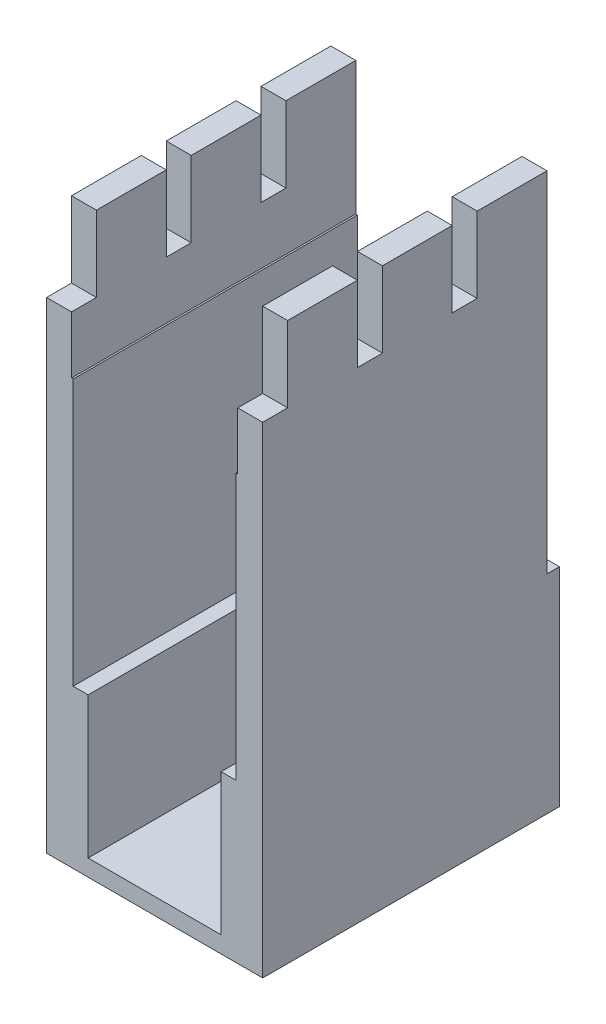
ISO-10303-21;
HEADER;
FILE_DESCRIPTION(('STEP AP214'),'2;1');
FILE_NAME('part.step','',(''),(''),'','','');
FILE_SCHEMA(('AUTOMOTIVE_DESIGN { 1 0 10303 214 1 1 1 1 }'));
ENDSEC;
DATA;
#1=APPLICATION_CONTEXT('core data for automotive mechanical design processes');
#2=APPLICATION_PROTOCOL_DEFINITION('international standard','automotive_design',2000,#1);
#3=PRODUCT_CONTEXT('',#1,'mechanical');
#4=PRODUCT('Part','Part','',(#3));
#5=PRODUCT_RELATED_PRODUCT_CATEGORY('part','',(#4));
#6=PRODUCT_DEFINITION_FORMATION('','',#4);
#7=PRODUCT_DEFINITION_CONTEXT('part definition',#1,'design');
#8=PRODUCT_DEFINITION('design','',#6,#7);
#9=PRODUCT_DEFINITION_SHAPE('','',#8);
#10=(LENGTH_UNIT() NAMED_UNIT(*) SI_UNIT(.MILLI.,.METRE.));
#11=(NAMED_UNIT(*) PLANE_ANGLE_UNIT() SI_UNIT($,.RADIAN.));
#12=(NAMED_UNIT(*) SI_UNIT($,.STERADIAN.) SOLID_ANGLE_UNIT());
#13=UNCERTAINTY_MEASURE_WITH_UNIT(LENGTH_MEASURE(1.E-05),#10,'distance_accuracy_value','');
#14=(GEOMETRIC_REPRESENTATION_CONTEXT(3) GLOBAL_UNCERTAINTY_ASSIGNED_CONTEXT((#13)) GLOBAL_UNIT_ASSIGNED_CONTEXT((#10,
#11,#12)) REPRESENTATION_CONTEXT('',''));
#15=CARTESIAN_POINT('',(0.,0.,0.));
#16=DIRECTION('',(0.,0.,1.));
#17=DIRECTION('',(1.,0.,0.));
#18=AXIS2_PLACEMENT_3D('',#15,#16,#17);
#19=CARTESIAN_POINT('',(0.,0.,0.));
#20=DIRECTION('',(0.,0.,1.));
#21=DIRECTION('',(1.,0.,0.));
#22=AXIS2_PLACEMENT_3D('',#19,#20,#21);
#23=PLANE('',#22);
#24=DIRECTION('',(1.,0.,0.));
#25=VECTOR('',#24,1.);
#26=CARTESIAN_POINT('',(13.,25.,0.));
#27=LINE('',#26,#25);
#28=CARTESIAN_POINT('',(-13.,25.,0.));
#29=VERTEX_POINT('',#28);
#30=CARTESIAN_POINT('',(-9.8,25.,0.));
#31=VERTEX_POINT('',#30);
#32=EDGE_CURVE('E50',#29,#31,#27,.T.);
#33=ORIENTED_EDGE('',*,*,#32,.F.);
#34=DIRECTION('',(0.,-1.,0.));
#35=VECTOR('',#34,1.);
#36=CARTESIAN_POINT('',(-13.,67.,0.));
#37=LINE('',#36,#35);
#38=CARTESIAN_POINT('',(-13.,67.,0.));
#39=VERTEX_POINT('',#38);
#40=EDGE_CURVE('E522',#39,#29,#37,.T.);
#41=ORIENTED_EDGE('',*,*,#40,.F.);
#42=DIRECTION('',(-1.,0.,0.));
#43=VECTOR('',#42,1.);
#44=CARTESIAN_POINT('',(-10.,67.,0.));
#45=LINE('',#44,#43);
#46=CARTESIAN_POINT('',(-10.,67.,0.));
#47=VERTEX_POINT('',#46);
#48=EDGE_CURVE('E518',#47,#39,#45,.T.);
#49=ORIENTED_EDGE('',*,*,#48,.F.);
#50=DIRECTION('',(0.,1.,0.));
#51=VECTOR('',#50,1.);
#52=CARTESIAN_POINT('',(-10.,51.,0.));
#53=LINE('',#52,#51);
#54=CARTESIAN_POINT('',(-10.,51.,0.));
#55=VERTEX_POINT('',#54);
#56=EDGE_CURVE('E573',#55,#47,#53,.T.);
#57=ORIENTED_EDGE('',*,*,#56,.F.);
#58=DIRECTION('',(-1.,0.,0.));
#59=VECTOR('',#58,1.);
#60=CARTESIAN_POINT('',(-9.8,51.,0.));
#61=LINE('',#60,#59);
#62=CARTESIAN_POINT('',(-9.8,51.,0.));
#63=VERTEX_POINT('',#62);
#64=EDGE_CURVE('E569',#63,#55,#61,.T.);
#65=ORIENTED_EDGE('',*,*,#64,.F.);
#66=DIRECTION('',(0.,1.,0.));
#67=VECTOR('',#66,1.);
#68=CARTESIAN_POINT('',(-9.8,51.,0.));
#69=LINE('',#68,#67);
#70=EDGE_CURVE('E564',#31,#63,#69,.T.);
#71=ORIENTED_EDGE('',*,*,#70,.F.);
#72=EDGE_LOOP('',(#33,#41,#49,#57,#65,#71));
#73=FACE_BOUND('',#72,.T.);
#74=ADVANCED_FACE('F39',(#73),#23,.F.);
#75=CARTESIAN_POINT('',(9.8,25.,0.));
#76=VERTEX_POINT('',#75);
#77=CARTESIAN_POINT('',(13.,25.,0.));
#78=VERTEX_POINT('',#77);
#79=EDGE_CURVE('E11',#76,#78,#27,.T.);
#80=ORIENTED_EDGE('',*,*,#79,.F.);
#81=DIRECTION('',(0.,-1.,0.));
#82=VECTOR('',#81,1.);
#83=CARTESIAN_POINT('',(9.8,51.,0.));
#84=LINE('',#83,#82);
#85=CARTESIAN_POINT('',(9.8,51.,0.));
#86=VERTEX_POINT('',#85);
#87=EDGE_CURVE('E541',#86,#76,#84,.T.);
#88=ORIENTED_EDGE('',*,*,#87,.F.);
#89=DIRECTION('',(-1.,0.,0.));
#90=VECTOR('',#89,1.);
#91=CARTESIAN_POINT('',(10.,51.,0.));
#92=LINE('',#91,#90);
#93=CARTESIAN_POINT('',(10.,51.,0.));
#94=VERTEX_POINT('',#93);
#95=EDGE_CURVE('E536',#94,#86,#92,.T.);
#96=ORIENTED_EDGE('',*,*,#95,.F.);
#97=DIRECTION('',(0.,-1.,0.));
#98=VECTOR('',#97,1.);
#99=CARTESIAN_POINT('',(10.,67.,0.));
#100=LINE('',#99,#98);
#101=CARTESIAN_POINT('',(10.,67.,0.));
#102=VERTEX_POINT('',#101);
#103=EDGE_CURVE('E532',#102,#94,#100,.T.);
#104=ORIENTED_EDGE('',*,*,#103,.F.);
#105=DIRECTION('',(-1.,0.,0.));
#106=VECTOR('',#105,1.);
#107=CARTESIAN_POINT('',(13.,67.,0.));
#108=LINE('',#107,#106);
#109=CARTESIAN_POINT('',(13.,67.,0.));
#110=VERTEX_POINT('',#109);
#111=EDGE_CURVE('E528',#110,#102,#108,.T.);
#112=ORIENTED_EDGE('',*,*,#111,.F.);
#113=DIRECTION('',(0.,1.,0.));
#114=VECTOR('',#113,1.);
#115=CARTESIAN_POINT('',(13.,0.,0.));
#116=LINE('',#115,#114);
#117=EDGE_CURVE('E525',#78,#110,#116,.T.);
#118=ORIENTED_EDGE('',*,*,#117,.F.);
#119=EDGE_LOOP('',(#80,#88,#96,#104,#112,#118));
#120=FACE_BOUND('',#119,.T.);
#121=ADVANCED_FACE('F727',(#120),#23,.F.);
#122=CARTESIAN_POINT('',(-10.,67.,54.));
#123=DIRECTION('',(0.,-1.,0.));
#124=DIRECTION('',(0.,0.,-1.));
#125=AXIS2_PLACEMENT_3D('',#122,#123,#124);
#126=PLANE('',#125);
#127=DIRECTION('',(1.,0.,0.));
#128=VECTOR('',#127,1.);
#129=CARTESIAN_POINT('',(-13.,67.,31.2));
#130=LINE('',#129,#128);
#131=CARTESIAN_POINT('',(-13.,67.,31.2));
#132=VERTEX_POINT('',#131);
#133=CARTESIAN_POINT('',(-10.,67.,31.2));
#134=VERTEX_POINT('',#133);
#135=EDGE_CURVE('E356',#132,#134,#130,.T.);
#136=ORIENTED_EDGE('',*,*,#135,.T.);
#137=DIRECTION('',(0.,0.,-1.));
#138=VECTOR('',#137,1.);
#139=CARTESIAN_POINT('',(-10.,67.,54.));
#140=LINE('',#139,#138);
#141=CARTESIAN_POINT('',(-10.,67.,22.8));
#142=VERTEX_POINT('',#141);
#143=EDGE_CURVE('E581',#134,#142,#140,.T.);
#144=ORIENTED_EDGE('',*,*,#143,.T.);
#145=DIRECTION('',(1.,0.,0.));
#146=VECTOR('',#145,1.);
#147=CARTESIAN_POINT('',(-13.,67.,22.8));
#148=LINE('',#147,#146);
#149=CARTESIAN_POINT('',(-13.,67.,22.8));
#150=VERTEX_POINT('',#149);
#151=EDGE_CURVE('E452',#150,#142,#148,.T.);
#152=ORIENTED_EDGE('',*,*,#151,.F.);
#153=DIRECTION('',(0.,0.,-1.));
#154=VECTOR('',#153,1.);
#155=CARTESIAN_POINT('',(-13.,67.,54.));
#156=LINE('',#155,#154);
#157=EDGE_CURVE('E630',#132,#150,#156,.T.);
#158=ORIENTED_EDGE('',*,*,#157,.F.);
#159=EDGE_LOOP('',(#136,#144,#152,#158));
#160=FACE_BOUND('',#159,.T.);
#161=ADVANCED_FACE('F41',(#160),#126,.F.);
#162=DIRECTION('',(1.,0.,0.));
#163=VECTOR('',#162,1.);
#164=CARTESIAN_POINT('',(-13.,67.,8.4));
#165=LINE('',#164,#163);
#166=CARTESIAN_POINT('',(-13.,67.,8.4));
#167=VERTEX_POINT('',#166);
#168=CARTESIAN_POINT('',(-10.,67.,8.4));
#169=VERTEX_POINT('',#168);
#170=EDGE_CURVE('E378',#167,#169,#165,.T.);
#171=ORIENTED_EDGE('',*,*,#170,.T.);
#172=EDGE_CURVE('E577',#169,#47,#140,.T.);
#173=ORIENTED_EDGE('',*,*,#172,.T.);
#174=ORIENTED_EDGE('',*,*,#48,.T.);
#175=EDGE_CURVE('E626',#167,#39,#156,.T.);
#176=ORIENTED_EDGE('',*,*,#175,.F.);
#177=EDGE_LOOP('',(#171,#173,#174,#176));
#178=FACE_BOUND('',#177,.T.);
#179=ADVANCED_FACE('F712',(#178),#126,.F.);
#180=CARTESIAN_POINT('',(-10.,67.,19.8));
#181=VERTEX_POINT('',#180);
#182=CARTESIAN_POINT('',(-10.,67.,11.4));
#183=VERTEX_POINT('',#182);
#184=EDGE_CURVE('E580',#181,#183,#140,.T.);
#185=ORIENTED_EDGE('',*,*,#184,.T.);
#186=DIRECTION('',(1.,0.,0.));
#187=VECTOR('',#186,1.);
#188=CARTESIAN_POINT('',(-13.,67.,11.4));
#189=LINE('',#188,#187);
#190=CARTESIAN_POINT('',(-13.,67.,11.4));
#191=VERTEX_POINT('',#190);
#192=EDGE_CURVE('E374',#191,#183,#189,.T.);
#193=ORIENTED_EDGE('',*,*,#192,.F.);
#194=CARTESIAN_POINT('',(-13.,67.,19.8));
#195=VERTEX_POINT('',#194);
#196=EDGE_CURVE('E629',#195,#191,#156,.T.);
#197=ORIENTED_EDGE('',*,*,#196,.F.);
#198=DIRECTION('',(1.,0.,0.));
#199=VECTOR('',#198,1.);
#200=CARTESIAN_POINT('',(-13.,67.,19.8));
#201=LINE('',#200,#199);
#202=EDGE_CURVE('E456',#195,#181,#201,.T.);
#203=ORIENTED_EDGE('',*,*,#202,.T.);
#204=EDGE_LOOP('',(#185,#193,#197,#203));
#205=FACE_BOUND('',#204,.T.);
#206=ADVANCED_FACE('F679',(#205),#126,.F.);
#207=CARTESIAN_POINT('',(-13.,67.,54.));
#208=DIRECTION('',(1.,0.,0.));
#209=DIRECTION('',(0.,1.,0.));
#210=AXIS2_PLACEMENT_3D('',#207,#208,#209);
#211=PLANE('',#210);
#212=DIRECTION('',(0.,-1.,0.));
#213=VECTOR('',#212,1.);
#214=CARTESIAN_POINT('',(-13.,0.,31.2));
#215=LINE('',#214,#213);
#216=CARTESIAN_POINT('',(-13.,57.9,31.2));
#217=VERTEX_POINT('',#216);
#218=EDGE_CURVE('E390',#132,#217,#215,.T.);
#219=ORIENTED_EDGE('',*,*,#218,.F.);
#220=ORIENTED_EDGE('',*,*,#157,.T.);
#221=DIRECTION('',(0.,-1.,0.));
#222=VECTOR('',#221,1.);
#223=CARTESIAN_POINT('',(-13.,0.,22.8));
#224=LINE('',#223,#222);
#225=CARTESIAN_POINT('',(-13.,57.9,22.8));
#226=VERTEX_POINT('',#225);
#227=EDGE_CURVE('E421',#150,#226,#224,.T.);
#228=ORIENTED_EDGE('',*,*,#227,.T.);
#229=DIRECTION('',(0.,0.,-1.));
#230=VECTOR('',#229,1.);
#231=CARTESIAN_POINT('',(-13.,57.9,0.));
#232=LINE('',#231,#230);
#233=CARTESIAN_POINT('',(-13.,57.9,19.8));
#234=VERTEX_POINT('',#233);
#235=EDGE_CURVE('E426',#226,#234,#232,.T.);
#236=ORIENTED_EDGE('',*,*,#235,.T.);
#237=DIRECTION('',(0.,-1.,0.));
#238=VECTOR('',#237,1.);
#239=CARTESIAN_POINT('',(-13.,0.,19.8));
#240=LINE('',#239,#238);
#241=EDGE_CURVE('E418',#195,#234,#240,.T.);
#242=ORIENTED_EDGE('',*,*,#241,.F.);
#243=ORIENTED_EDGE('',*,*,#196,.T.);
#244=DIRECTION('',(0.,-1.,0.));
#245=VECTOR('',#244,1.);
#246=CARTESIAN_POINT('',(-13.,0.,11.4));
#247=LINE('',#246,#245);
#248=CARTESIAN_POINT('',(-13.,57.9,11.4));
#249=VERTEX_POINT('',#248);
#250=EDGE_CURVE('E341',#191,#249,#247,.T.);
#251=ORIENTED_EDGE('',*,*,#250,.T.);
#252=DIRECTION('',(0.,0.,-1.));
#253=VECTOR('',#252,1.);
#254=CARTESIAN_POINT('',(-13.,57.9,0.));
#255=LINE('',#254,#253);
#256=CARTESIAN_POINT('',(-13.,57.9,8.4));
#257=VERTEX_POINT('',#256);
#258=EDGE_CURVE('E346',#249,#257,#255,.T.);
#259=ORIENTED_EDGE('',*,*,#258,.T.);
#260=DIRECTION('',(0.,-1.,0.));
#261=VECTOR('',#260,1.);
#262=CARTESIAN_POINT('',(-13.,0.,8.4));
#263=LINE('',#262,#261);
#264=EDGE_CURVE('E338',#167,#257,#263,.T.);
#265=ORIENTED_EDGE('',*,*,#264,.F.);
#266=ORIENTED_EDGE('',*,*,#175,.T.);
#267=ORIENTED_EDGE('',*,*,#40,.T.);
#268=DIRECTION('',(0.,0.,1.));
#269=VECTOR('',#268,1.);
#270=CARTESIAN_POINT('',(-13.,25.,-1.5));
#271=LINE('',#270,#269);
#272=CARTESIAN_POINT('',(-13.,25.,-1.5));
#273=VERTEX_POINT('',#272);
#274=EDGE_CURVE('E334',#273,#29,#271,.T.);
#275=ORIENTED_EDGE('',*,*,#274,.F.);
#276=DIRECTION('',(0.,1.,0.));
#277=VECTOR('',#276,1.);
#278=CARTESIAN_POINT('',(-13.,0.,-1.5));
#279=LINE('',#278,#277);
#280=CARTESIAN_POINT('',(-13.,0.,-1.5));
#281=VERTEX_POINT('',#280);
#282=EDGE_CURVE('E317',#281,#273,#279,.T.);
#283=ORIENTED_EDGE('',*,*,#282,.F.);
#284=DIRECTION('',(0.,0.,-1.));
#285=VECTOR('',#284,1.);
#286=CARTESIAN_POINT('',(-13.,0.,54.));
#287=LINE('',#286,#285);
#288=CARTESIAN_POINT('',(-13.,0.,34.2));
#289=VERTEX_POINT('',#288);
#290=EDGE_CURVE('E307',#289,#281,#287,.T.);
#291=ORIENTED_EDGE('',*,*,#290,.F.);
#292=DIRECTION('',(0.,-1.,0.));
#293=VECTOR('',#292,1.);
#294=CARTESIAN_POINT('',(-13.,0.,34.2));
#295=LINE('',#294,#293);
#296=CARTESIAN_POINT('',(-13.,57.9,34.2));
#297=VERTEX_POINT('',#296);
#298=EDGE_CURVE('E382',#297,#289,#295,.T.);
#299=ORIENTED_EDGE('',*,*,#298,.F.);
#300=DIRECTION('',(0.,0.,-1.));
#301=VECTOR('',#300,1.);
#302=CARTESIAN_POINT('',(-13.,57.9,0.));
#303=LINE('',#302,#301);
#304=EDGE_CURVE('E385',#297,#217,#303,.T.);
#305=ORIENTED_EDGE('',*,*,#304,.T.);
#306=EDGE_LOOP('',(#219,#220,#228,#236,#242,#243,#251,#259,#265,#266,#267,#275,#283,#291,#299,#305));
#307=FACE_BOUND('',#306,.T.);
#308=ADVANCED_FACE('F692',(#307),#211,.F.);
#309=CARTESIAN_POINT('',(-13.,0.,54.));
#310=DIRECTION('',(0.,1.,0.));
#311=DIRECTION('',(-1.,0.,0.));
#312=AXIS2_PLACEMENT_3D('',#309,#310,#311);
#313=PLANE('',#312);
#314=DIRECTION('',(1.,0.,0.));
#315=VECTOR('',#314,1.);
#316=CARTESIAN_POINT('',(-13.,0.,34.2));
#317=LINE('',#316,#315);
#318=CARTESIAN_POINT('',(13.,0.,34.2));
#319=VERTEX_POINT('',#318);
#320=EDGE_CURVE('E393',#289,#319,#317,.T.);
#321=ORIENTED_EDGE('',*,*,#320,.F.);
#322=ORIENTED_EDGE('',*,*,#290,.T.);
#323=DIRECTION('',(-1.,0.,0.));
#324=VECTOR('',#323,1.);
#325=CARTESIAN_POINT('',(13.,0.,-1.5));
#326=LINE('',#325,#324);
#327=CARTESIAN_POINT('',(13.,0.,-1.5));
#328=VERTEX_POINT('',#327);
#329=EDGE_CURVE('E311',#328,#281,#326,.T.);
#330=ORIENTED_EDGE('',*,*,#329,.F.);
#331=DIRECTION('',(0.,0.,-1.));
#332=VECTOR('',#331,1.);
#333=CARTESIAN_POINT('',(13.,0.,54.));
#334=LINE('',#333,#332);
#335=EDGE_CURVE('E294',#319,#328,#334,.T.);
#336=ORIENTED_EDGE('',*,*,#335,.F.);
#337=EDGE_LOOP('',(#321,#322,#330,#336));
#338=FACE_BOUND('',#337,.T.);
#339=ADVANCED_FACE('F312',(#338),#313,.F.);
#340=CARTESIAN_POINT('',(13.,0.,54.));
#341=DIRECTION('',(-1.,0.,0.));
#342=DIRECTION('',(0.,-1.,0.));
#343=AXIS2_PLACEMENT_3D('',#340,#341,#342);
#344=PLANE('',#343);
#345=DIRECTION('',(0.,-1.,0.));
#346=VECTOR('',#345,1.);
#347=CARTESIAN_POINT('',(13.,0.,31.2));
#348=LINE('',#347,#346);
#349=CARTESIAN_POINT('',(13.,67.,31.2));
#350=VERTEX_POINT('',#349);
#351=CARTESIAN_POINT('',(13.,57.9,31.2));
#352=VERTEX_POINT('',#351);
#353=EDGE_CURVE('E386',#350,#352,#348,.T.);
#354=ORIENTED_EDGE('',*,*,#353,.T.);
#355=DIRECTION('',(0.,0.,-1.));
#356=VECTOR('',#355,1.);
#357=CARTESIAN_POINT('',(13.,57.9,0.));
#358=LINE('',#357,#356);
#359=CARTESIAN_POINT('',(13.,57.9,34.2));
#360=VERTEX_POINT('',#359);
#361=EDGE_CURVE('E396',#360,#352,#358,.T.);
#362=ORIENTED_EDGE('',*,*,#361,.F.);
#363=DIRECTION('',(0.,-1.,0.));
#364=VECTOR('',#363,1.);
#365=CARTESIAN_POINT('',(13.,0.,34.2));
#366=LINE('',#365,#364);
#367=EDGE_CURVE('E303',#360,#319,#366,.T.);
#368=ORIENTED_EDGE('',*,*,#367,.T.);
#369=ORIENTED_EDGE('',*,*,#335,.T.);
#370=DIRECTION('',(0.,-1.,0.));
#371=VECTOR('',#370,1.);
#372=CARTESIAN_POINT('',(13.,0.,-1.5));
#373=LINE('',#372,#371);
#374=CARTESIAN_POINT('',(13.,25.,-1.5));
#375=VERTEX_POINT('',#374);
#376=EDGE_CURVE('E300',#375,#328,#373,.T.);
#377=ORIENTED_EDGE('',*,*,#376,.F.);
#378=DIRECTION('',(0.,0.,1.));
#379=VECTOR('',#378,1.);
#380=CARTESIAN_POINT('',(13.,25.,-1.5));
#381=LINE('',#380,#379);
#382=EDGE_CURVE('E330',#375,#78,#381,.T.);
#383=ORIENTED_EDGE('',*,*,#382,.T.);
#384=ORIENTED_EDGE('',*,*,#117,.T.);
#385=DIRECTION('',(0.,0.,-1.));
#386=VECTOR('',#385,1.);
#387=CARTESIAN_POINT('',(13.,67.,54.));
#388=LINE('',#387,#386);
#389=CARTESIAN_POINT('',(13.,67.,8.4));
#390=VERTEX_POINT('',#389);
#391=EDGE_CURVE('E619',#390,#110,#388,.T.);
#392=ORIENTED_EDGE('',*,*,#391,.F.);
#393=DIRECTION('',(0.,-1.,0.));
#394=VECTOR('',#393,1.);
#395=CARTESIAN_POINT('',(13.,0.,8.4));
#396=LINE('',#395,#394);
#397=CARTESIAN_POINT('',(13.,57.9,8.4));
#398=VERTEX_POINT('',#397);
#399=EDGE_CURVE('E351',#390,#398,#396,.T.);
#400=ORIENTED_EDGE('',*,*,#399,.T.);
#401=DIRECTION('',(0.,0.,-1.));
#402=VECTOR('',#401,1.);
#403=CARTESIAN_POINT('',(13.,57.9,0.));
#404=LINE('',#403,#402);
#405=CARTESIAN_POINT('',(13.,57.9,11.4));
#406=VERTEX_POINT('',#405);
#407=EDGE_CURVE('E342',#406,#398,#404,.T.);
#408=ORIENTED_EDGE('',*,*,#407,.F.);
#409=DIRECTION('',(0.,-1.,0.));
#410=VECTOR('',#409,1.);
#411=CARTESIAN_POINT('',(13.,0.,11.4));
#412=LINE('',#411,#410);
#413=CARTESIAN_POINT('',(13.,67.,11.4));
#414=VERTEX_POINT('',#413);
#415=EDGE_CURVE('E355',#414,#406,#412,.T.);
#416=ORIENTED_EDGE('',*,*,#415,.F.);
#417=CARTESIAN_POINT('',(13.,67.,19.8));
#418=VERTEX_POINT('',#417);
#419=EDGE_CURVE('E622',#418,#414,#388,.T.);
#420=ORIENTED_EDGE('',*,*,#419,.F.);
#421=DIRECTION('',(0.,-1.,0.));
#422=VECTOR('',#421,1.);
#423=CARTESIAN_POINT('',(13.,0.,19.8));
#424=LINE('',#423,#422);
#425=CARTESIAN_POINT('',(13.,57.9,19.8));
#426=VERTEX_POINT('',#425);
#427=EDGE_CURVE('E367',#418,#426,#424,.T.);
#428=ORIENTED_EDGE('',*,*,#427,.T.);
#429=DIRECTION('',(0.,0.,-1.));
#430=VECTOR('',#429,1.);
#431=CARTESIAN_POINT('',(13.,57.9,0.));
#432=LINE('',#431,#430);
#433=CARTESIAN_POINT('',(13.,57.9,22.8));
#434=VERTEX_POINT('',#433);
#435=EDGE_CURVE('E422',#434,#426,#432,.T.);
#436=ORIENTED_EDGE('',*,*,#435,.F.);
#437=DIRECTION('',(0.,-1.,0.));
#438=VECTOR('',#437,1.);
#439=CARTESIAN_POINT('',(13.,0.,22.8));
#440=LINE('',#439,#438);
#441=CARTESIAN_POINT('',(13.,67.,22.8));
#442=VERTEX_POINT('',#441);
#443=EDGE_CURVE('E434',#442,#434,#440,.T.);
#444=ORIENTED_EDGE('',*,*,#443,.F.);
#445=EDGE_CURVE('E308',#350,#442,#388,.T.);
#446=ORIENTED_EDGE('',*,*,#445,.F.);
#447=EDGE_LOOP('',(#354,#362,#368,#369,#377,#383,#384,#392,#400,#408,#416,#420,#428,#436,#444,#446));
#448=FACE_BOUND('',#447,.T.);
#449=ADVANCED_FACE('F297',(#448),#344,.F.);
#450=CARTESIAN_POINT('',(13.,67.,54.));
#451=DIRECTION('',(0.,-1.,0.));
#452=DIRECTION('',(0.,0.,-1.));
#453=AXIS2_PLACEMENT_3D('',#450,#451,#452);
#454=PLANE('',#453);
#455=CARTESIAN_POINT('',(10.,67.,31.2));
#456=VERTEX_POINT('',#455);
#457=EDGE_CURVE('E405',#456,#350,#130,.T.);
#458=ORIENTED_EDGE('',*,*,#457,.T.);
#459=ORIENTED_EDGE('',*,*,#445,.T.);
#460=CARTESIAN_POINT('',(10.,67.,22.8));
#461=VERTEX_POINT('',#460);
#462=EDGE_CURVE('E455',#461,#442,#148,.T.);
#463=ORIENTED_EDGE('',*,*,#462,.F.);
#464=DIRECTION('',(0.,0.,-1.));
#465=VECTOR('',#464,1.);
#466=CARTESIAN_POINT('',(10.,67.,54.));
#467=LINE('',#466,#465);
#468=EDGE_CURVE('E618',#456,#461,#467,.T.);
#469=ORIENTED_EDGE('',*,*,#468,.F.);
#470=EDGE_LOOP('',(#458,#459,#463,#469));
#471=FACE_BOUND('',#470,.T.);
#472=ADVANCED_FACE('F761',(#471),#454,.F.);
#473=CARTESIAN_POINT('',(10.,67.,8.4));
#474=VERTEX_POINT('',#473);
#475=EDGE_CURVE('E350',#474,#390,#165,.T.);
#476=ORIENTED_EDGE('',*,*,#475,.T.);
#477=ORIENTED_EDGE('',*,*,#391,.T.);
#478=ORIENTED_EDGE('',*,*,#111,.T.);
#479=EDGE_CURVE('E614',#474,#102,#467,.T.);
#480=ORIENTED_EDGE('',*,*,#479,.F.);
#481=EDGE_LOOP('',(#476,#477,#478,#480));
#482=FACE_BOUND('',#481,.T.);
#483=ADVANCED_FACE('F724',(#482),#454,.F.);
#484=ORIENTED_EDGE('',*,*,#419,.T.);
#485=CARTESIAN_POINT('',(10.,67.,11.4));
#486=VERTEX_POINT('',#485);
#487=EDGE_CURVE('E377',#486,#414,#189,.T.);
#488=ORIENTED_EDGE('',*,*,#487,.F.);
#489=CARTESIAN_POINT('',(10.,67.,19.8));
#490=VERTEX_POINT('',#489);
#491=EDGE_CURVE('E617',#490,#486,#467,.T.);
#492=ORIENTED_EDGE('',*,*,#491,.F.);
#493=EDGE_CURVE('E430',#490,#418,#201,.T.);
#494=ORIENTED_EDGE('',*,*,#493,.T.);
#495=EDGE_LOOP('',(#484,#488,#492,#494));
#496=FACE_BOUND('',#495,.T.);
#497=ADVANCED_FACE('F773',(#496),#454,.F.);
#498=CARTESIAN_POINT('',(10.,67.,54.));
#499=DIRECTION('',(1.,0.,0.));
#500=DIRECTION('',(0.,1.,0.));
#501=AXIS2_PLACEMENT_3D('',#498,#499,#500);
#502=PLANE('',#501);
#503=DIRECTION('',(0.,-1.,0.));
#504=VECTOR('',#503,1.);
#505=CARTESIAN_POINT('',(10.,67.,31.2));
#506=LINE('',#505,#504);
#507=CARTESIAN_POINT('',(10.,57.9,31.2));
#508=VERTEX_POINT('',#507);
#509=EDGE_CURVE('E515',#456,#508,#506,.T.);
#510=ORIENTED_EDGE('',*,*,#509,.F.);
#511=ORIENTED_EDGE('',*,*,#468,.T.);
#512=DIRECTION('',(0.,-1.,0.));
#513=VECTOR('',#512,1.);
#514=CARTESIAN_POINT('',(10.,67.,22.8));
#515=LINE('',#514,#513);
#516=CARTESIAN_POINT('',(10.,57.9,22.8));
#517=VERTEX_POINT('',#516);
#518=EDGE_CURVE('E445',#461,#517,#515,.T.);
#519=ORIENTED_EDGE('',*,*,#518,.T.);
#520=DIRECTION('',(0.,0.,-1.));
#521=VECTOR('',#520,1.);
#522=CARTESIAN_POINT('',(10.,57.9,54.));
#523=LINE('',#522,#521);
#524=CARTESIAN_POINT('',(10.,57.9,19.8));
#525=VERTEX_POINT('',#524);
#526=EDGE_CURVE('E463',#517,#525,#523,.T.);
#527=ORIENTED_EDGE('',*,*,#526,.T.);
#528=DIRECTION('',(0.,-1.,0.));
#529=VECTOR('',#528,1.);
#530=CARTESIAN_POINT('',(10.,67.,19.8));
#531=LINE('',#530,#529);
#532=EDGE_CURVE('E467',#490,#525,#531,.T.);
#533=ORIENTED_EDGE('',*,*,#532,.F.);
#534=ORIENTED_EDGE('',*,*,#491,.T.);
#535=DIRECTION('',(0.,-1.,0.));
#536=VECTOR('',#535,1.);
#537=CARTESIAN_POINT('',(10.,67.,11.4));
#538=LINE('',#537,#536);
#539=CARTESIAN_POINT('',(10.,57.9,11.4));
#540=VERTEX_POINT('',#539);
#541=EDGE_CURVE('E470',#486,#540,#538,.T.);
#542=ORIENTED_EDGE('',*,*,#541,.T.);
#543=DIRECTION('',(0.,0.,-1.));
#544=VECTOR('',#543,1.);
#545=CARTESIAN_POINT('',(10.,57.9,54.));
#546=LINE('',#545,#544);
#547=CARTESIAN_POINT('',(10.,57.9,8.4));
#548=VERTEX_POINT('',#547);
#549=EDGE_CURVE('E474',#540,#548,#546,.T.);
#550=ORIENTED_EDGE('',*,*,#549,.T.);
#551=DIRECTION('',(0.,-1.,0.));
#552=VECTOR('',#551,1.);
#553=CARTESIAN_POINT('',(10.,67.,8.4));
#554=LINE('',#553,#552);
#555=EDGE_CURVE('E478',#474,#548,#554,.T.);
#556=ORIENTED_EDGE('',*,*,#555,.F.);
#557=ORIENTED_EDGE('',*,*,#479,.T.);
#558=ORIENTED_EDGE('',*,*,#103,.T.);
#559=DIRECTION('',(0.,0.,-1.));
#560=VECTOR('',#559,1.);
#561=CARTESIAN_POINT('',(10.,51.,54.));
#562=LINE('',#561,#560);
#563=CARTESIAN_POINT('',(10.,51.,34.2));
#564=VERTEX_POINT('',#563);
#565=EDGE_CURVE('E611',#564,#94,#562,.T.);
#566=ORIENTED_EDGE('',*,*,#565,.F.);
#567=DIRECTION('',(0.,-1.,0.));
#568=VECTOR('',#567,1.);
#569=CARTESIAN_POINT('',(10.,67.,34.2));
#570=LINE('',#569,#568);
#571=CARTESIAN_POINT('',(10.,57.9,34.2));
#572=VERTEX_POINT('',#571);
#573=EDGE_CURVE('E508',#572,#564,#570,.T.);
#574=ORIENTED_EDGE('',*,*,#573,.F.);
#575=DIRECTION('',(0.,0.,-1.));
#576=VECTOR('',#575,1.);
#577=CARTESIAN_POINT('',(10.,57.9,54.));
#578=LINE('',#577,#576);
#579=EDGE_CURVE('E511',#572,#508,#578,.T.);
#580=ORIENTED_EDGE('',*,*,#579,.T.);
#581=EDGE_LOOP('',(#510,#511,#519,#527,#533,#534,#542,#550,#556,#557,#558,#566,#574,#580));
#582=FACE_BOUND('',#581,.T.);
#583=ADVANCED_FACE('F732',(#582),#502,.F.);
#584=CARTESIAN_POINT('',(10.,51.,54.));
#585=DIRECTION('',(0.,-1.,0.));
#586=DIRECTION('',(0.,0.,-1.));
#587=AXIS2_PLACEMENT_3D('',#584,#585,#586);
#588=PLANE('',#587);
#589=DIRECTION('',(-1.,0.,0.));
#590=VECTOR('',#589,1.);
#591=CARTESIAN_POINT('',(10.,51.,34.2));
#592=LINE('',#591,#590);
#593=CARTESIAN_POINT('',(9.8,51.,34.2));
#594=VERTEX_POINT('',#593);
#595=EDGE_CURVE('E505',#564,#594,#592,.T.);
#596=ORIENTED_EDGE('',*,*,#595,.F.);
#597=ORIENTED_EDGE('',*,*,#565,.T.);
#598=ORIENTED_EDGE('',*,*,#95,.T.);
#599=DIRECTION('',(0.,0.,-1.));
#600=VECTOR('',#599,1.);
#601=CARTESIAN_POINT('',(9.8,51.,54.));
#602=LINE('',#601,#600);
#603=EDGE_CURVE('E608',#594,#86,#602,.T.);
#604=ORIENTED_EDGE('',*,*,#603,.F.);
#605=EDGE_LOOP('',(#596,#597,#598,#604));
#606=FACE_BOUND('',#605,.T.);
#607=ADVANCED_FACE('F1106',(#606),#588,.F.);
#608=CARTESIAN_POINT('',(9.8,51.,54.));
#609=DIRECTION('',(1.,0.,0.));
#610=DIRECTION('',(0.,1.,0.));
#611=AXIS2_PLACEMENT_3D('',#608,#609,#610);
#612=PLANE('',#611);
#613=DIRECTION('',(0.,-1.,0.));
#614=VECTOR('',#613,1.);
#615=CARTESIAN_POINT('',(9.8,51.,34.2));
#616=LINE('',#615,#614);
#617=CARTESIAN_POINT('',(9.8,19.,34.2));
#618=VERTEX_POINT('',#617);
#619=EDGE_CURVE('E502',#594,#618,#616,.T.);
#620=ORIENTED_EDGE('',*,*,#619,.F.);
#621=ORIENTED_EDGE('',*,*,#603,.T.);
#622=ORIENTED_EDGE('',*,*,#87,.T.);
#623=CARTESIAN_POINT('',(9.8,19.,0.));
#624=VERTEX_POINT('',#623);
#625=EDGE_CURVE('E540',#76,#624,#84,.T.);
#626=ORIENTED_EDGE('',*,*,#625,.T.);
#627=DIRECTION('',(0.,0.,-1.));
#628=VECTOR('',#627,1.);
#629=CARTESIAN_POINT('',(9.8,19.,54.));
#630=LINE('',#629,#628);
#631=EDGE_CURVE('E604',#618,#624,#630,.T.);
#632=ORIENTED_EDGE('',*,*,#631,.F.);
#633=EDGE_LOOP('',(#620,#621,#622,#626,#632));
#634=FACE_BOUND('',#633,.T.);
#635=ADVANCED_FACE('F811',(#634),#612,.F.);
#636=CARTESIAN_POINT('',(9.8,19.,54.));
#637=DIRECTION('',(0.,-1.,0.));
#638=DIRECTION('',(0.,0.,-1.));
#639=AXIS2_PLACEMENT_3D('',#636,#637,#638);
#640=PLANE('',#639);
#641=DIRECTION('',(-1.,0.,0.));
#642=VECTOR('',#641,1.);
#643=CARTESIAN_POINT('',(9.8,19.,34.2));
#644=LINE('',#643,#642);
#645=CARTESIAN_POINT('',(8.,19.,34.2));
#646=VERTEX_POINT('',#645);
#647=EDGE_CURVE('E499',#618,#646,#644,.T.);
#648=ORIENTED_EDGE('',*,*,#647,.F.);
#649=ORIENTED_EDGE('',*,*,#631,.T.);
#650=DIRECTION('',(-1.,0.,0.));
#651=VECTOR('',#650,1.);
#652=CARTESIAN_POINT('',(9.8,19.,0.));
#653=LINE('',#652,#651);
#654=CARTESIAN_POINT('',(8.,19.,0.));
#655=VERTEX_POINT('',#654);
#656=EDGE_CURVE('E544',#624,#655,#653,.T.);
#657=ORIENTED_EDGE('',*,*,#656,.T.);
#658=DIRECTION('',(0.,0.,-1.));
#659=VECTOR('',#658,1.);
#660=CARTESIAN_POINT('',(8.,19.,54.));
#661=LINE('',#660,#659);
#662=EDGE_CURVE('E601',#646,#655,#661,.T.);
#663=ORIENTED_EDGE('',*,*,#662,.F.);
#664=EDGE_LOOP('',(#648,#649,#657,#663));
#665=FACE_BOUND('',#664,.T.);
#666=ADVANCED_FACE('F814',(#665),#640,.F.);
#667=CARTESIAN_POINT('',(8.,19.,54.));
#668=DIRECTION('',(1.,0.,0.));
#669=DIRECTION('',(0.,1.,0.));
#670=AXIS2_PLACEMENT_3D('',#667,#668,#669);
#671=PLANE('',#670);
#672=DIRECTION('',(0.,-1.,0.));
#673=VECTOR('',#672,1.);
#674=CARTESIAN_POINT('',(8.,19.,34.2));
#675=LINE('',#674,#673);
#676=CARTESIAN_POINT('',(8.,2.00000000000001,34.2));
#677=VERTEX_POINT('',#676);
#678=EDGE_CURVE('E496',#646,#677,#675,.T.);
#679=ORIENTED_EDGE('',*,*,#678,.F.);
#680=ORIENTED_EDGE('',*,*,#662,.T.);
#681=DIRECTION('',(0.,-1.,0.));
#682=VECTOR('',#681,1.);
#683=CARTESIAN_POINT('',(8.,19.,0.));
#684=LINE('',#683,#682);
#685=CARTESIAN_POINT('',(8.,2.00000000000001,0.));
#686=VERTEX_POINT('',#685);
#687=EDGE_CURVE('E548',#655,#686,#684,.T.);
#688=ORIENTED_EDGE('',*,*,#687,.T.);
#689=DIRECTION('',(0.,0.,-1.));
#690=VECTOR('',#689,1.);
#691=CARTESIAN_POINT('',(8.,2.00000000000001,54.));
#692=LINE('',#691,#690);
#693=EDGE_CURVE('E598',#677,#686,#692,.T.);
#694=ORIENTED_EDGE('',*,*,#693,.F.);
#695=EDGE_LOOP('',(#679,#680,#688,#694));
#696=FACE_BOUND('',#695,.T.);
#697=ADVANCED_FACE('F820',(#696),#671,.F.);
#698=CARTESIAN_POINT('',(-8.,2.00000000000001,54.));
#699=DIRECTION('',(0.,-1.,0.));
#700=DIRECTION('',(1.,0.,0.));
#701=AXIS2_PLACEMENT_3D('',#698,#699,#700);
#702=PLANE('',#701);
#703=DIRECTION('',(-1.,0.,0.));
#704=VECTOR('',#703,1.);
#705=CARTESIAN_POINT('',(-8.,2.00000000000001,34.2));
#706=LINE('',#705,#704);
#707=CARTESIAN_POINT('',(-8.,2.00000000000001,34.2));
#708=VERTEX_POINT('',#707);
#709=EDGE_CURVE('E493',#677,#708,#706,.T.);
#710=ORIENTED_EDGE('',*,*,#709,.F.);
#711=ORIENTED_EDGE('',*,*,#693,.T.);
#712=DIRECTION('',(-1.,0.,0.));
#713=VECTOR('',#712,1.);
#714=CARTESIAN_POINT('',(-8.,2.00000000000001,0.));
#715=LINE('',#714,#713);
#716=CARTESIAN_POINT('',(-8.,2.00000000000001,0.));
#717=VERTEX_POINT('',#716);
#718=EDGE_CURVE('E552',#686,#717,#715,.T.);
#719=ORIENTED_EDGE('',*,*,#718,.T.);
#720=DIRECTION('',(0.,0.,-1.));
#721=VECTOR('',#720,1.);
#722=CARTESIAN_POINT('',(-8.,2.00000000000001,54.));
#723=LINE('',#722,#721);
#724=EDGE_CURVE('E595',#708,#717,#723,.T.);
#725=ORIENTED_EDGE('',*,*,#724,.F.);
#726=EDGE_LOOP('',(#710,#711,#719,#725));
#727=FACE_BOUND('',#726,.T.);
#728=ADVANCED_FACE('F823',(#727),#702,.F.);
#729=CARTESIAN_POINT('',(-8.,19.,54.));
#730=DIRECTION('',(-1.,0.,0.));
#731=DIRECTION('',(0.,-1.,0.));
#732=AXIS2_PLACEMENT_3D('',#729,#730,#731);
#733=PLANE('',#732);
#734=DIRECTION('',(0.,1.,0.));
#735=VECTOR('',#734,1.);
#736=CARTESIAN_POINT('',(-8.,19.,34.2));
#737=LINE('',#736,#735);
#738=CARTESIAN_POINT('',(-8.,19.,34.2));
#739=VERTEX_POINT('',#738);
#740=EDGE_CURVE('E490',#708,#739,#737,.T.);
#741=ORIENTED_EDGE('',*,*,#740,.F.);
#742=ORIENTED_EDGE('',*,*,#724,.T.);
#743=DIRECTION('',(0.,1.,0.));
#744=VECTOR('',#743,1.);
#745=CARTESIAN_POINT('',(-8.,19.,0.));
#746=LINE('',#745,#744);
#747=CARTESIAN_POINT('',(-8.,19.,0.));
#748=VERTEX_POINT('',#747);
#749=EDGE_CURVE('E556',#717,#748,#746,.T.);
#750=ORIENTED_EDGE('',*,*,#749,.T.);
#751=DIRECTION('',(0.,0.,-1.));
#752=VECTOR('',#751,1.);
#753=CARTESIAN_POINT('',(-8.,19.,54.));
#754=LINE('',#753,#752);
#755=EDGE_CURVE('E592',#739,#748,#754,.T.);
#756=ORIENTED_EDGE('',*,*,#755,.F.);
#757=EDGE_LOOP('',(#741,#742,#750,#756));
#758=FACE_BOUND('',#757,.T.);
#759=ADVANCED_FACE('F830',(#758),#733,.F.);
#760=CARTESIAN_POINT('',(-9.8,19.,54.));
#761=DIRECTION('',(0.,-1.,0.));
#762=DIRECTION('',(0.,0.,-1.));
#763=AXIS2_PLACEMENT_3D('',#760,#761,#762);
#764=PLANE('',#763);
#765=DIRECTION('',(-1.,0.,0.));
#766=VECTOR('',#765,1.);
#767=CARTESIAN_POINT('',(-9.8,19.,34.2));
#768=LINE('',#767,#766);
#769=CARTESIAN_POINT('',(-9.8,19.,34.2));
#770=VERTEX_POINT('',#769);
#771=EDGE_CURVE('E487',#739,#770,#768,.T.);
#772=ORIENTED_EDGE('',*,*,#771,.F.);
#773=ORIENTED_EDGE('',*,*,#755,.T.);
#774=DIRECTION('',(-1.,0.,0.));
#775=VECTOR('',#774,1.);
#776=CARTESIAN_POINT('',(-9.8,19.,0.));
#777=LINE('',#776,#775);
#778=CARTESIAN_POINT('',(-9.8,19.,0.));
#779=VERTEX_POINT('',#778);
#780=EDGE_CURVE('E560',#748,#779,#777,.T.);
#781=ORIENTED_EDGE('',*,*,#780,.T.);
#782=DIRECTION('',(0.,0.,-1.));
#783=VECTOR('',#782,1.);
#784=CARTESIAN_POINT('',(-9.8,19.,54.));
#785=LINE('',#784,#783);
#786=EDGE_CURVE('E589',#770,#779,#785,.T.);
#787=ORIENTED_EDGE('',*,*,#786,.F.);
#788=EDGE_LOOP('',(#772,#773,#781,#787));
#789=FACE_BOUND('',#788,.T.);
#790=ADVANCED_FACE('F832',(#789),#764,.F.);
#791=CARTESIAN_POINT('',(-9.8,51.,54.));
#792=DIRECTION('',(-1.,0.,0.));
#793=DIRECTION('',(0.,-1.,0.));
#794=AXIS2_PLACEMENT_3D('',#791,#792,#793);
#795=PLANE('',#794);
#796=DIRECTION('',(0.,1.,0.));
#797=VECTOR('',#796,1.);
#798=CARTESIAN_POINT('',(-9.8,51.,34.2));
#799=LINE('',#798,#797);
#800=CARTESIAN_POINT('',(-9.8,51.,34.2));
#801=VERTEX_POINT('',#800);
#802=EDGE_CURVE('E484',#770,#801,#799,.T.);
#803=ORIENTED_EDGE('',*,*,#802,.F.);
#804=ORIENTED_EDGE('',*,*,#786,.T.);
#805=EDGE_CURVE('E565',#779,#31,#69,.T.);
#806=ORIENTED_EDGE('',*,*,#805,.T.);
#807=ORIENTED_EDGE('',*,*,#70,.T.);
#808=DIRECTION('',(0.,0.,-1.));
#809=VECTOR('',#808,1.);
#810=CARTESIAN_POINT('',(-9.8,51.,54.));
#811=LINE('',#810,#809);
#812=EDGE_CURVE('E585',#801,#63,#811,.T.);
#813=ORIENTED_EDGE('',*,*,#812,.F.);
#814=EDGE_LOOP('',(#803,#804,#806,#807,#813));
#815=FACE_BOUND('',#814,.T.);
#816=ADVANCED_FACE('F797',(#815),#795,.F.);
#817=CARTESIAN_POINT('',(-9.8,51.,54.));
#818=DIRECTION('',(0.,-1.,0.));
#819=DIRECTION('',(0.,0.,-1.));
#820=AXIS2_PLACEMENT_3D('',#817,#818,#819);
#821=PLANE('',#820);
#822=DIRECTION('',(-1.,0.,0.));
#823=VECTOR('',#822,1.);
#824=CARTESIAN_POINT('',(-9.8,51.,34.2));
#825=LINE('',#824,#823);
#826=CARTESIAN_POINT('',(-10.,51.,34.2));
#827=VERTEX_POINT('',#826);
#828=EDGE_CURVE('E481',#801,#827,#825,.T.);
#829=ORIENTED_EDGE('',*,*,#828,.F.);
#830=ORIENTED_EDGE('',*,*,#812,.T.);
#831=ORIENTED_EDGE('',*,*,#64,.T.);
#832=DIRECTION('',(0.,0.,-1.));
#833=VECTOR('',#832,1.);
#834=CARTESIAN_POINT('',(-10.,51.,54.));
#835=LINE('',#834,#833);
#836=EDGE_CURVE('E582',#827,#55,#835,.T.);
#837=ORIENTED_EDGE('',*,*,#836,.F.);
#838=EDGE_LOOP('',(#829,#830,#831,#837));
#839=FACE_BOUND('',#838,.T.);
#840=ADVANCED_FACE('F705',(#839),#821,.F.);
#841=CARTESIAN_POINT('',(-10.,51.,54.));
#842=DIRECTION('',(-1.,0.,0.));
#843=DIRECTION('',(0.,-1.,0.));
#844=AXIS2_PLACEMENT_3D('',#841,#842,#843);
#845=PLANE('',#844);
#846=DIRECTION('',(0.,1.,0.));
#847=VECTOR('',#846,1.);
#848=CARTESIAN_POINT('',(-10.,51.,31.2));
#849=LINE('',#848,#847);
#850=CARTESIAN_POINT('',(-10.,57.9,31.2));
#851=VERTEX_POINT('',#850);
#852=EDGE_CURVE('E43',#851,#134,#849,.T.);
#853=ORIENTED_EDGE('',*,*,#852,.F.);
#854=DIRECTION('',(0.,0.,1.));
#855=VECTOR('',#854,1.);
#856=CARTESIAN_POINT('',(-10.,57.9,54.));
#857=LINE('',#856,#855);
#858=CARTESIAN_POINT('',(-10.,57.9,34.2));
#859=VERTEX_POINT('',#858);
#860=EDGE_CURVE('E655',#851,#859,#857,.T.);
#861=ORIENTED_EDGE('',*,*,#860,.T.);
#862=DIRECTION('',(0.,1.,0.));
#863=VECTOR('',#862,1.);
#864=CARTESIAN_POINT('',(-10.,51.,34.2));
#865=LINE('',#864,#863);
#866=EDGE_CURVE('E653',#827,#859,#865,.T.);
#867=ORIENTED_EDGE('',*,*,#866,.F.);
#868=ORIENTED_EDGE('',*,*,#836,.T.);
#869=ORIENTED_EDGE('',*,*,#56,.T.);
#870=ORIENTED_EDGE('',*,*,#172,.F.);
#871=DIRECTION('',(0.,1.,0.));
#872=VECTOR('',#871,1.);
#873=CARTESIAN_POINT('',(-10.,51.,8.4));
#874=LINE('',#873,#872);
#875=CARTESIAN_POINT('',(-10.,57.9,8.4));
#876=VERTEX_POINT('',#875);
#877=EDGE_CURVE('E650',#876,#169,#874,.T.);
#878=ORIENTED_EDGE('',*,*,#877,.F.);
#879=DIRECTION('',(0.,0.,1.));
#880=VECTOR('',#879,1.);
#881=CARTESIAN_POINT('',(-10.,57.9,54.));
#882=LINE('',#881,#880);
#883=CARTESIAN_POINT('',(-10.,57.9,11.4));
#884=VERTEX_POINT('',#883);
#885=EDGE_CURVE('E646',#876,#884,#882,.T.);
#886=ORIENTED_EDGE('',*,*,#885,.T.);
#887=DIRECTION('',(0.,1.,0.));
#888=VECTOR('',#887,1.);
#889=CARTESIAN_POINT('',(-10.,51.,11.4));
#890=LINE('',#889,#888);
#891=EDGE_CURVE('E642',#884,#183,#890,.T.);
#892=ORIENTED_EDGE('',*,*,#891,.T.);
#893=ORIENTED_EDGE('',*,*,#184,.F.);
#894=DIRECTION('',(0.,1.,0.));
#895=VECTOR('',#894,1.);
#896=CARTESIAN_POINT('',(-10.,51.,19.8));
#897=LINE('',#896,#895);
#898=CARTESIAN_POINT('',(-10.,57.9,19.8));
#899=VERTEX_POINT('',#898);
#900=EDGE_CURVE('E639',#899,#181,#897,.T.);
#901=ORIENTED_EDGE('',*,*,#900,.F.);
#902=DIRECTION('',(0.,0.,1.));
#903=VECTOR('',#902,1.);
#904=CARTESIAN_POINT('',(-10.,57.9,54.));
#905=LINE('',#904,#903);
#906=CARTESIAN_POINT('',(-10.,57.9,22.8));
#907=VERTEX_POINT('',#906);
#908=EDGE_CURVE('E635',#899,#907,#905,.T.);
#909=ORIENTED_EDGE('',*,*,#908,.T.);
#910=DIRECTION('',(0.,1.,0.));
#911=VECTOR('',#910,1.);
#912=CARTESIAN_POINT('',(-10.,51.,22.8));
#913=LINE('',#912,#911);
#914=EDGE_CURVE('E631',#907,#142,#913,.T.);
#915=ORIENTED_EDGE('',*,*,#914,.T.);
#916=ORIENTED_EDGE('',*,*,#143,.F.);
#917=EDGE_LOOP('',(#853,#861,#867,#868,#869,#870,#878,#886,#892,#893,#901,#909,#915,#916));
#918=FACE_BOUND('',#917,.T.);
#919=ADVANCED_FACE('F672',(#918),#845,.F.);
#920=CARTESIAN_POINT('',(-13.,0.,22.8));
#921=DIRECTION('',(0.,0.,1.));
#922=DIRECTION('',(1.,0.,0.));
#923=AXIS2_PLACEMENT_3D('',#920,#921,#922);
#924=PLANE('',#923);
#925=DIRECTION('',(1.,0.,0.));
#926=VECTOR('',#925,1.);
#927=CARTESIAN_POINT('',(-13.,57.9,22.8));
#928=LINE('',#927,#926);
#929=EDGE_CURVE('E447',#226,#907,#928,.T.);
#930=ORIENTED_EDGE('',*,*,#929,.F.);
#931=ORIENTED_EDGE('',*,*,#227,.F.);
#932=ORIENTED_EDGE('',*,*,#151,.T.);
#933=ORIENTED_EDGE('',*,*,#914,.F.);
#934=EDGE_LOOP('',(#930,#931,#932,#933));
#935=FACE_BOUND('',#934,.T.);
#936=ADVANCED_FACE('F851',(#935),#924,.F.);
#937=CARTESIAN_POINT('',(-13.,57.9,0.));
#938=DIRECTION('',(0.,-1.,0.));
#939=DIRECTION('',(1.,0.,0.));
#940=AXIS2_PLACEMENT_3D('',#937,#938,#939);
#941=PLANE('',#940);
#942=DIRECTION('',(1.,0.,0.));
#943=VECTOR('',#942,1.);
#944=CARTESIAN_POINT('',(-13.,57.9,19.8));
#945=LINE('',#944,#943);
#946=EDGE_CURVE('E441',#234,#899,#945,.T.);
#947=ORIENTED_EDGE('',*,*,#946,.F.);
#948=ORIENTED_EDGE('',*,*,#235,.F.);
#949=ORIENTED_EDGE('',*,*,#929,.T.);
#950=ORIENTED_EDGE('',*,*,#908,.F.);
#951=EDGE_LOOP('',(#947,#948,#949,#950));
#952=FACE_BOUND('',#951,.T.);
#953=ADVANCED_FACE('F868',(#952),#941,.F.);
#954=CARTESIAN_POINT('',(-13.,0.,19.8));
#955=DIRECTION('',(0.,0.,1.));
#956=DIRECTION('',(1.,0.,0.));
#957=AXIS2_PLACEMENT_3D('',#954,#955,#956);
#958=PLANE('',#957);
#959=ORIENTED_EDGE('',*,*,#900,.T.);
#960=ORIENTED_EDGE('',*,*,#202,.F.);
#961=ORIENTED_EDGE('',*,*,#241,.T.);
#962=ORIENTED_EDGE('',*,*,#946,.T.);
#963=EDGE_LOOP('',(#959,#960,#961,#962));
#964=FACE_BOUND('',#963,.T.);
#965=ADVANCED_FACE('F875',(#964),#958,.T.);
#966=CARTESIAN_POINT('',(-13.,0.,11.4));
#967=DIRECTION('',(0.,0.,1.));
#968=DIRECTION('',(1.,0.,0.));
#969=AXIS2_PLACEMENT_3D('',#966,#967,#968);
#970=PLANE('',#969);
#971=DIRECTION('',(1.,0.,0.));
#972=VECTOR('',#971,1.);
#973=CARTESIAN_POINT('',(-13.,57.9,11.4));
#974=LINE('',#973,#972);
#975=EDGE_CURVE('E369',#249,#884,#974,.T.);
#976=ORIENTED_EDGE('',*,*,#975,.F.);
#977=ORIENTED_EDGE('',*,*,#250,.F.);
#978=ORIENTED_EDGE('',*,*,#192,.T.);
#979=ORIENTED_EDGE('',*,*,#891,.F.);
#980=EDGE_LOOP('',(#976,#977,#978,#979));
#981=FACE_BOUND('',#980,.T.);
#982=ADVANCED_FACE('F685',(#981),#970,.F.);
#983=CARTESIAN_POINT('',(-13.,57.9,0.));
#984=DIRECTION('',(0.,-1.,0.));
#985=DIRECTION('',(1.,0.,0.));
#986=AXIS2_PLACEMENT_3D('',#983,#984,#985);
#987=PLANE('',#986);
#988=DIRECTION('',(1.,0.,0.));
#989=VECTOR('',#988,1.);
#990=CARTESIAN_POINT('',(-13.,57.9,8.4));
#991=LINE('',#990,#989);
#992=EDGE_CURVE('E363',#257,#876,#991,.T.);
#993=ORIENTED_EDGE('',*,*,#992,.F.);
#994=ORIENTED_EDGE('',*,*,#258,.F.);
#995=ORIENTED_EDGE('',*,*,#975,.T.);
#996=ORIENTED_EDGE('',*,*,#885,.F.);
#997=EDGE_LOOP('',(#993,#994,#995,#996));
#998=FACE_BOUND('',#997,.T.);
#999=ADVANCED_FACE('F689',(#998),#987,.F.);
#1000=CARTESIAN_POINT('',(-13.,0.,8.4));
#1001=DIRECTION('',(0.,0.,1.));
#1002=DIRECTION('',(1.,0.,0.));
#1003=AXIS2_PLACEMENT_3D('',#1000,#1001,#1002);
#1004=PLANE('',#1003);
#1005=ORIENTED_EDGE('',*,*,#877,.T.);
#1006=ORIENTED_EDGE('',*,*,#170,.F.);
#1007=ORIENTED_EDGE('',*,*,#264,.T.);
#1008=ORIENTED_EDGE('',*,*,#992,.T.);
#1009=EDGE_LOOP('',(#1005,#1006,#1007,#1008));
#1010=FACE_BOUND('',#1009,.T.);
#1011=ADVANCED_FACE('F715',(#1010),#1004,.T.);
#1012=CARTESIAN_POINT('',(-13.,0.,31.2));
#1013=DIRECTION('',(0.,0.,1.));
#1014=DIRECTION('',(1.,0.,0.));
#1015=AXIS2_PLACEMENT_3D('',#1012,#1013,#1014);
#1016=PLANE('',#1015);
#1017=ORIENTED_EDGE('',*,*,#509,.T.);
#1018=DIRECTION('',(1.,0.,0.));
#1019=VECTOR('',#1018,1.);
#1020=CARTESIAN_POINT('',(-13.,57.9,31.2));
#1021=LINE('',#1020,#1019);
#1022=EDGE_CURVE('E410',#508,#352,#1021,.T.);
#1023=ORIENTED_EDGE('',*,*,#1022,.T.);
#1024=ORIENTED_EDGE('',*,*,#353,.F.);
#1025=ORIENTED_EDGE('',*,*,#457,.F.);
#1026=EDGE_LOOP('',(#1017,#1023,#1024,#1025));
#1027=FACE_BOUND('',#1026,.T.);
#1028=ADVANCED_FACE('F758',(#1027),#1016,.T.);
#1029=ORIENTED_EDGE('',*,*,#852,.T.);
#1030=ORIENTED_EDGE('',*,*,#135,.F.);
#1031=ORIENTED_EDGE('',*,*,#218,.T.);
#1032=EDGE_CURVE('E406',#217,#851,#1021,.T.);
#1033=ORIENTED_EDGE('',*,*,#1032,.T.);
#1034=EDGE_LOOP('',(#1029,#1030,#1031,#1033));
#1035=FACE_BOUND('',#1034,.T.);
#1036=ADVANCED_FACE('F663',(#1035),#1016,.T.);
#1037=CARTESIAN_POINT('',(-13.,57.9,0.));
#1038=DIRECTION('',(0.,-1.,0.));
#1039=DIRECTION('',(1.,0.,0.));
#1040=AXIS2_PLACEMENT_3D('',#1037,#1038,#1039);
#1041=PLANE('',#1040);
#1042=DIRECTION('',(1.,0.,0.));
#1043=VECTOR('',#1042,1.);
#1044=CARTESIAN_POINT('',(-13.,57.9,34.2));
#1045=LINE('',#1044,#1043);
#1046=EDGE_CURVE('E415',#572,#360,#1045,.T.);
#1047=ORIENTED_EDGE('',*,*,#1046,.T.);
#1048=ORIENTED_EDGE('',*,*,#361,.T.);
#1049=ORIENTED_EDGE('',*,*,#1022,.F.);
#1050=ORIENTED_EDGE('',*,*,#579,.F.);
#1051=EDGE_LOOP('',(#1047,#1048,#1049,#1050));
#1052=FACE_BOUND('',#1051,.T.);
#1053=ADVANCED_FACE('F752',(#1052),#1041,.F.);
#1054=ORIENTED_EDGE('',*,*,#1032,.F.);
#1055=ORIENTED_EDGE('',*,*,#304,.F.);
#1056=EDGE_CURVE('E411',#297,#859,#1045,.T.);
#1057=ORIENTED_EDGE('',*,*,#1056,.T.);
#1058=ORIENTED_EDGE('',*,*,#860,.F.);
#1059=EDGE_LOOP('',(#1054,#1055,#1057,#1058));
#1060=FACE_BOUND('',#1059,.T.);
#1061=ADVANCED_FACE('F699',(#1060),#1041,.F.);
#1062=CARTESIAN_POINT('',(-13.,0.,34.2));
#1063=DIRECTION('',(0.,0.,1.));
#1064=DIRECTION('',(0.,-1.,0.));
#1065=AXIS2_PLACEMENT_3D('',#1062,#1063,#1064);
#1066=PLANE('',#1065);
#1067=ORIENTED_EDGE('',*,*,#573,.T.);
#1068=ORIENTED_EDGE('',*,*,#595,.T.);
#1069=ORIENTED_EDGE('',*,*,#619,.T.);
#1070=ORIENTED_EDGE('',*,*,#647,.T.);
#1071=ORIENTED_EDGE('',*,*,#678,.T.);
#1072=ORIENTED_EDGE('',*,*,#709,.T.);
#1073=ORIENTED_EDGE('',*,*,#740,.T.);
#1074=ORIENTED_EDGE('',*,*,#771,.T.);
#1075=ORIENTED_EDGE('',*,*,#802,.T.);
#1076=ORIENTED_EDGE('',*,*,#828,.T.);
#1077=ORIENTED_EDGE('',*,*,#866,.T.);
#1078=ORIENTED_EDGE('',*,*,#1056,.F.);
#1079=ORIENTED_EDGE('',*,*,#298,.T.);
#1080=ORIENTED_EDGE('',*,*,#320,.T.);
#1081=ORIENTED_EDGE('',*,*,#367,.F.);
#1082=ORIENTED_EDGE('',*,*,#1046,.F.);
#1083=EDGE_LOOP('',(#1067,#1068,#1069,#1070,#1071,#1072,#1073,#1074,#1075,#1076,#1077,#1078,
#1079,#1080,#1081,#1082));
#1084=FACE_BOUND('',#1083,.T.);
#1085=ADVANCED_FACE('F701',(#1084),#1066,.T.);
#1086=ORIENTED_EDGE('',*,*,#532,.T.);
#1087=EDGE_CURVE('E446',#525,#426,#945,.T.);
#1088=ORIENTED_EDGE('',*,*,#1087,.T.);
#1089=ORIENTED_EDGE('',*,*,#427,.F.);
#1090=ORIENTED_EDGE('',*,*,#493,.F.);
#1091=EDGE_LOOP('',(#1086,#1088,#1089,#1090));
#1092=FACE_BOUND('',#1091,.T.);
#1093=ADVANCED_FACE('F782',(#1092),#958,.T.);
#1094=EDGE_CURVE('E451',#517,#434,#928,.T.);
#1095=ORIENTED_EDGE('',*,*,#1094,.T.);
#1096=ORIENTED_EDGE('',*,*,#435,.T.);
#1097=ORIENTED_EDGE('',*,*,#1087,.F.);
#1098=ORIENTED_EDGE('',*,*,#526,.F.);
#1099=EDGE_LOOP('',(#1095,#1096,#1097,#1098));
#1100=FACE_BOUND('',#1099,.T.);
#1101=ADVANCED_FACE('F787',(#1100),#941,.F.);
#1102=ORIENTED_EDGE('',*,*,#462,.T.);
#1103=ORIENTED_EDGE('',*,*,#443,.T.);
#1104=ORIENTED_EDGE('',*,*,#1094,.F.);
#1105=ORIENTED_EDGE('',*,*,#518,.F.);
#1106=EDGE_LOOP('',(#1102,#1103,#1104,#1105));
#1107=FACE_BOUND('',#1106,.T.);
#1108=ADVANCED_FACE('F790',(#1107),#924,.F.);
#1109=ORIENTED_EDGE('',*,*,#555,.T.);
#1110=EDGE_CURVE('E368',#548,#398,#991,.T.);
#1111=ORIENTED_EDGE('',*,*,#1110,.T.);
#1112=ORIENTED_EDGE('',*,*,#399,.F.);
#1113=ORIENTED_EDGE('',*,*,#475,.F.);
#1114=EDGE_LOOP('',(#1109,#1111,#1112,#1113));
#1115=FACE_BOUND('',#1114,.T.);
#1116=ADVANCED_FACE('F738',(#1115),#1004,.T.);
#1117=EDGE_CURVE('E373',#540,#406,#974,.T.);
#1118=ORIENTED_EDGE('',*,*,#1117,.T.);
#1119=ORIENTED_EDGE('',*,*,#407,.T.);
#1120=ORIENTED_EDGE('',*,*,#1110,.F.);
#1121=ORIENTED_EDGE('',*,*,#549,.F.);
#1122=EDGE_LOOP('',(#1118,#1119,#1120,#1121));
#1123=FACE_BOUND('',#1122,.T.);
#1124=ADVANCED_FACE('F740',(#1123),#987,.F.);
#1125=ORIENTED_EDGE('',*,*,#487,.T.);
#1126=ORIENTED_EDGE('',*,*,#415,.T.);
#1127=ORIENTED_EDGE('',*,*,#1117,.F.);
#1128=ORIENTED_EDGE('',*,*,#541,.F.);
#1129=EDGE_LOOP('',(#1125,#1126,#1127,#1128));
#1130=FACE_BOUND('',#1129,.T.);
#1131=ADVANCED_FACE('F777',(#1130),#970,.F.);
#1132=CARTESIAN_POINT('',(0.,0.,0.));
#1133=DIRECTION('',(0.,0.,1.));
#1134=DIRECTION('',(1.,0.,0.));
#1135=AXIS2_PLACEMENT_3D('',#1132,#1133,#1134);
#1136=PLANE('',#1135);
#1137=ORIENTED_EDGE('',*,*,#805,.F.);
#1138=ORIENTED_EDGE('',*,*,#780,.F.);
#1139=ORIENTED_EDGE('',*,*,#749,.F.);
#1140=ORIENTED_EDGE('',*,*,#718,.F.);
#1141=ORIENTED_EDGE('',*,*,#687,.F.);
#1142=ORIENTED_EDGE('',*,*,#656,.F.);
#1143=ORIENTED_EDGE('',*,*,#625,.F.);
#1144=EDGE_CURVE('E51',#31,#76,#27,.T.);
#1145=ORIENTED_EDGE('',*,*,#1144,.F.);
#1146=EDGE_LOOP('',(#1137,#1138,#1139,#1140,#1141,#1142,#1143,#1145));
#1147=FACE_BOUND('',#1146,.T.);
#1148=ADVANCED_FACE('F804',(#1147),#1136,.T.);
#1149=CARTESIAN_POINT('',(13.,25.,-1.5));
#1150=DIRECTION('',(0.,-1.,0.));
#1151=DIRECTION('',(1.,0.,0.));
#1152=AXIS2_PLACEMENT_3D('',#1149,#1150,#1151);
#1153=PLANE('',#1152);
#1154=ORIENTED_EDGE('',*,*,#32,.T.);
#1155=ORIENTED_EDGE('',*,*,#1144,.T.);
#1156=ORIENTED_EDGE('',*,*,#79,.T.);
#1157=ORIENTED_EDGE('',*,*,#382,.F.);
#1158=DIRECTION('',(1.,0.,0.));
#1159=VECTOR('',#1158,1.);
#1160=CARTESIAN_POINT('',(13.,25.,-1.5));
#1161=LINE('',#1160,#1159);
#1162=EDGE_CURVE('E321',#273,#375,#1161,.T.);
#1163=ORIENTED_EDGE('',*,*,#1162,.F.);
#1164=ORIENTED_EDGE('',*,*,#274,.T.);
#1165=EDGE_LOOP('',(#1154,#1155,#1156,#1157,#1163,#1164));
#1166=FACE_BOUND('',#1165,.T.);
#1167=ADVANCED_FACE('F718',(#1166),#1153,.F.);
#1168=CARTESIAN_POINT('',(0.,0.,-1.5));
#1169=DIRECTION('',(0.,0.,1.));
#1170=DIRECTION('',(1.,0.,0.));
#1171=AXIS2_PLACEMENT_3D('',#1168,#1169,#1170);
#1172=PLANE('',#1171);
#1173=ORIENTED_EDGE('',*,*,#376,.T.);
#1174=ORIENTED_EDGE('',*,*,#329,.T.);
#1175=ORIENTED_EDGE('',*,*,#282,.T.);
#1176=ORIENTED_EDGE('',*,*,#1162,.T.);
#1177=EDGE_LOOP('',(#1173,#1174,#1175,#1176));
#1178=FACE_BOUND('',#1177,.T.);
#1179=ADVANCED_FACE('F319',(#1178),#1172,.F.);
#1180=CLOSED_SHELL('',(#74,#121,#161,#179,#206,#308,#339,#449,#472,#483,#497,#583,#607,#635,
#666,#697,#728,#759,#790,#816,#840,#919,#936,#953,#965,#982,#999,#1011,#1028,#1036,#1053,#1061,
#1085,#1093,#1101,#1108,#1116,#1124,#1131,#1148,#1167,#1179));
#1181=MANIFOLD_SOLID_BREP('B2',#1180);
#1182=ADVANCED_BREP_SHAPE_REPRESENTATION('',(#18,#1181),#14);
#1183=SHAPE_DEFINITION_REPRESENTATION(#9,#1182);
ENDSEC;
END-ISO-10303-21;
